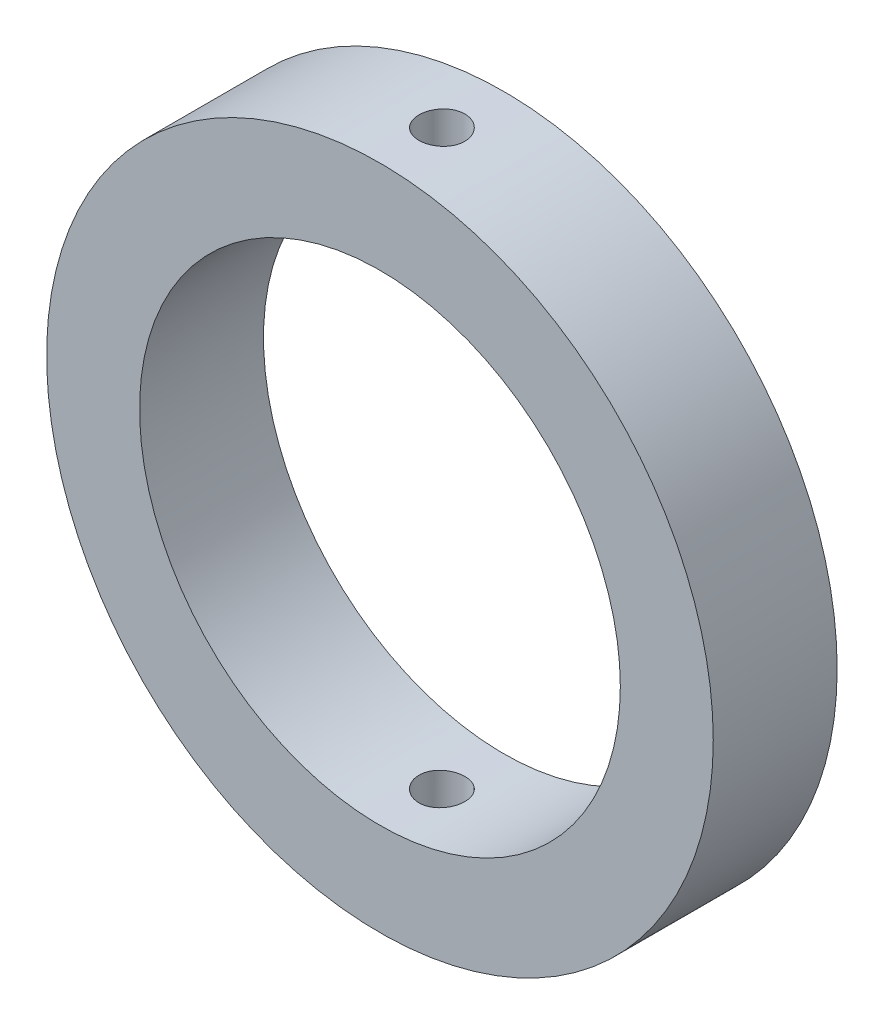
ISO-10303-21;
HEADER;
FILE_DESCRIPTION(('STEP AP214'),'2;1');
FILE_NAME('part.step','',(''),(''),'','','');
FILE_SCHEMA(('AUTOMOTIVE_DESIGN { 1 0 10303 214 1 1 1 1 }'));
ENDSEC;
DATA;
#1=APPLICATION_CONTEXT('core data for automotive mechanical design processes');
#2=APPLICATION_PROTOCOL_DEFINITION('international standard','automotive_design',2000,#1);
#3=PRODUCT_CONTEXT('',#1,'mechanical');
#4=PRODUCT('Part','Part','',(#3));
#5=PRODUCT_RELATED_PRODUCT_CATEGORY('part','',(#4));
#6=PRODUCT_DEFINITION_FORMATION('','',#4);
#7=PRODUCT_DEFINITION_CONTEXT('part definition',#1,'design');
#8=PRODUCT_DEFINITION('design','',#6,#7);
#9=PRODUCT_DEFINITION_SHAPE('','',#8);
#10=(LENGTH_UNIT() NAMED_UNIT(*) SI_UNIT(.MILLI.,.METRE.));
#11=(NAMED_UNIT(*) PLANE_ANGLE_UNIT() SI_UNIT($,.RADIAN.));
#12=(NAMED_UNIT(*) SI_UNIT($,.STERADIAN.) SOLID_ANGLE_UNIT());
#13=UNCERTAINTY_MEASURE_WITH_UNIT(LENGTH_MEASURE(1.E-05),#10,'distance_accuracy_value','');
#14=(GEOMETRIC_REPRESENTATION_CONTEXT(3) GLOBAL_UNCERTAINTY_ASSIGNED_CONTEXT((#13)) GLOBAL_UNIT_ASSIGNED_CONTEXT((#10,
#11,#12)) REPRESENTATION_CONTEXT('',''));
#15=CARTESIAN_POINT('',(0.,0.,0.));
#16=DIRECTION('',(0.,0.,1.));
#17=DIRECTION('',(1.,0.,0.));
#18=AXIS2_PLACEMENT_3D('',#15,#16,#17);
#19=CARTESIAN_POINT('',(0.,0.,25.4));
#20=DIRECTION('',(0.,0.,1.));
#21=DIRECTION('',(1.,0.,0.));
#22=AXIS2_PLACEMENT_3D('',#19,#20,#21);
#23=PLANE('',#22);
#24=CARTESIAN_POINT('',(0.,0.,25.4));
#25=DIRECTION('',(0.,0.,1.));
#26=DIRECTION('',(1.,0.,0.));
#27=AXIS2_PLACEMENT_3D('',#24,#25,#26);
#28=CIRCLE('',#27,68.326);
#29=CARTESIAN_POINT('',(68.326,0.,25.4));
#30=VERTEX_POINT('',#29);
#31=EDGE_CURVE('E10',#30,#30,#28,.T.);
#32=ORIENTED_EDGE('',*,*,#31,.T.);
#33=EDGE_LOOP('',(#32));
#34=FACE_BOUND('',#33,.T.);
#35=CARTESIAN_POINT('',(0.,0.,25.4));
#36=DIRECTION('',(0.,0.,1.));
#37=DIRECTION('',(1.,0.,0.));
#38=AXIS2_PLACEMENT_3D('',#35,#36,#37);
#39=CIRCLE('',#38,49.276);
#40=CARTESIAN_POINT('',(49.276,0.,25.4));
#41=VERTEX_POINT('',#40);
#42=EDGE_CURVE('E48',#41,#41,#39,.T.);
#43=ORIENTED_EDGE('',*,*,#42,.F.);
#44=EDGE_LOOP('',(#43));
#45=FACE_BOUND('',#44,.T.);
#46=ADVANCED_FACE('F30',(#34,#45),#23,.T.);
#47=CARTESIAN_POINT('',(0.,0.,0.));
#48=DIRECTION('',(0.,0.,1.));
#49=DIRECTION('',(1.,0.,0.));
#50=AXIS2_PLACEMENT_3D('',#47,#48,#49);
#51=PLANE('',#50);
#52=CARTESIAN_POINT('',(0.,0.,0.));
#53=DIRECTION('',(0.,0.,1.));
#54=DIRECTION('',(1.,0.,0.));
#55=AXIS2_PLACEMENT_3D('',#52,#53,#54);
#56=CIRCLE('',#55,68.326);
#57=CARTESIAN_POINT('',(68.326,0.,0.));
#58=VERTEX_POINT('',#57);
#59=EDGE_CURVE('E43',#58,#58,#56,.T.);
#60=ORIENTED_EDGE('',*,*,#59,.F.);
#61=EDGE_LOOP('',(#60));
#62=FACE_BOUND('',#61,.T.);
#63=CARTESIAN_POINT('',(0.,0.,0.));
#64=DIRECTION('',(0.,0.,1.));
#65=DIRECTION('',(1.,0.,0.));
#66=AXIS2_PLACEMENT_3D('',#63,#64,#65);
#67=CIRCLE('',#66,49.276);
#68=CARTESIAN_POINT('',(49.276,0.,0.));
#69=VERTEX_POINT('',#68);
#70=EDGE_CURVE('E51',#69,#69,#67,.T.);
#71=ORIENTED_EDGE('',*,*,#70,.T.);
#72=EDGE_LOOP('',(#71));
#73=FACE_BOUND('',#72,.T.);
#74=ADVANCED_FACE('F84',(#62,#73),#51,.F.);
#75=CARTESIAN_POINT('',(0.,0.,25.4));
#76=DIRECTION('',(0.,0.,-1.));
#77=DIRECTION('',(-1.,0.,0.));
#78=AXIS2_PLACEMENT_3D('',#75,#76,#77);
#79=CYLINDRICAL_SURFACE('',#78,68.326);
#80=CARTESIAN_POINT('',(0.,-68.326,17.399));
#81=CARTESIAN_POINT('',(0.263610645152822,-68.3259978602102,17.3989884229259));
#82=CARTESIAN_POINT('',(0.527404481505065,-68.3244581324138,17.3767428771823));
#83=CARTESIAN_POINT('',(1.04770422302524,-68.3184638834212,17.2883225209762));
#84=CARTESIAN_POINT('',(1.3042013492933,-68.3140059942158,17.2220969494876));
#85=CARTESIAN_POINT('',(1.80229606338297,-68.3026795820063,17.0476312242923));
#86=CARTESIAN_POINT('',(2.04390158518749,-68.2958123559373,16.939413671361));
#87=CARTESIAN_POINT('',(2.50545675359367,-68.2804390301372,16.6840735878991));
#88=CARTESIAN_POINT('',(2.7254112555189,-68.271933299118,16.536959807397));
#89=CARTESIAN_POINT('',(3.13787460050528,-68.2542216431329,16.2077173897638));
#90=CARTESIAN_POINT('',(3.3303396565822,-68.2450146361151,16.0255339514284));
#91=CARTESIAN_POINT('',(3.68198583620943,-68.2269473021208,15.6314377748457));
#92=CARTESIAN_POINT('',(3.8411655501303,-68.2180869898396,15.4195237781484));
#93=CARTESIAN_POINT('',(4.12186228789359,-68.2017036998519,14.9717277396979));
#94=CARTESIAN_POINT('',(4.24334217520007,-68.1941820438906,14.7358223667491));
#95=CARTESIAN_POINT('',(4.4449534308283,-68.1813385730595,14.2469033361645));
#96=CARTESIAN_POINT('',(4.52508532087781,-68.1760167304327,13.9938898944434));
#97=CARTESIAN_POINT('',(4.64160239811352,-68.1681835134897,13.4783650225439));
#98=CARTESIAN_POINT('',(4.67805720624059,-68.1656676668804,13.2158693968949));
#99=CARTESIAN_POINT('',(4.70640026831244,-68.1637167740012,12.6884736494024));
#100=CARTESIAN_POINT('',(4.69828911675897,-68.1642816866346,12.4235735596812));
#101=CARTESIAN_POINT('',(4.63778820296504,-68.1684244566682,11.89936354669));
#102=CARTESIAN_POINT('',(4.58547386485522,-68.1719971817844,11.6400448722529));
#103=CARTESIAN_POINT('',(4.43816863188483,-68.1817449017789,11.1338781884618));
#104=CARTESIAN_POINT('',(4.34317743741749,-68.1879199149262,10.8870302666704));
#105=CARTESIAN_POINT('',(4.11312963564713,-68.2021822720805,10.4125703944967));
#106=CARTESIAN_POINT('',(3.97803891549148,-68.210271243107,10.1849750350472));
#107=CARTESIAN_POINT('',(3.67165147102744,-68.2274483986898,9.75566227408349));
#108=CARTESIAN_POINT('',(3.50035425110297,-68.2365365969234,9.55394522686783));
#109=CARTESIAN_POINT('',(3.12599198575879,-68.2547108856569,9.18167634418997));
#110=CARTESIAN_POINT('',(2.9228616847617,-68.2637969325567,9.01119012222284));
#111=CARTESIAN_POINT('',(2.49082784157897,-68.2809249344769,8.70672879825254));
#112=CARTESIAN_POINT('',(2.26192428849463,-68.2889668890556,8.57275371168886));
#113=CARTESIAN_POINT('',(1.78480109829735,-68.303101393241,8.34512287232549));
#114=CARTESIAN_POINT('',(1.53658021715572,-68.3091938171691,8.2514697187844));
#115=CARTESIAN_POINT('',(1.02788670927037,-68.3187411499996,8.10718561444557));
#116=CARTESIAN_POINT('',(0.767414255773689,-68.3221960961861,8.05655405548094));
#117=CARTESIAN_POINT('',(0.242180589545063,-68.3260743743921,7.99983194688857));
#118=CARTESIAN_POINT('',(-0.0225707853000747,-68.326503879253,7.99365070424962));
#119=CARTESIAN_POINT('',(-0.549347251431478,-68.3242993154578,8.02576755689911));
#120=CARTESIAN_POINT('',(-0.811372359932456,-68.3216652661579,8.06406537115719));
#121=CARTESIAN_POINT('',(-1.32500203407734,-68.3136340105422,8.18397808884638));
#122=CARTESIAN_POINT('',(-1.57661638628705,-68.3082394660752,8.2655512661346));
#123=CARTESIAN_POINT('',(-2.06258450166646,-68.29529387371,8.46965670536518));
#124=CARTESIAN_POINT('',(-2.29693807725074,-68.2877428023794,8.59218941236445));
#125=CARTESIAN_POINT('',(-2.7421468211103,-68.2713166838243,8.87496572797061));
#126=CARTESIAN_POINT('',(-2.95296352186296,-68.2624395230917,9.03526977600667));
#127=CARTESIAN_POINT('',(-3.34472667306219,-68.2443669088747,9.38895053934302));
#128=CARTESIAN_POINT('',(-3.52567276887244,-68.2351714516129,9.58232764724503));
#129=CARTESIAN_POINT('',(-3.8528665919556,-68.2174806341977,9.99705717111062));
#130=CARTESIAN_POINT('',(-3.99905538757578,-68.2089864788044,10.2184561386273));
#131=CARTESIAN_POINT('',(-4.25218148453881,-68.1936754972733,10.6827113372308));
#132=CARTESIAN_POINT('',(-4.35911906909952,-68.1868586590328,10.9255674134778));
#133=CARTESIAN_POINT('',(-4.53060557474557,-68.1756798171572,11.425629573712));
#134=CARTESIAN_POINT('',(-4.59519131079001,-68.1713156819474,11.682822983157));
#135=CARTESIAN_POINT('',(-4.68026090389999,-68.1655285324115,12.2044344038869));
#136=CARTESIAN_POINT('',(-4.70074530897967,-68.1641054815387,12.4688523253568));
#137=CARTESIAN_POINT('',(-4.69702524041087,-68.1643618784143,12.9968210797789));
#138=CARTESIAN_POINT('',(-4.67291339664706,-68.1660348953925,13.2603725735139));
#139=CARTESIAN_POINT('',(-4.58087762978648,-68.1722812733823,13.7796748767449));
#140=CARTESIAN_POINT('',(-4.51295363022275,-68.176854639456,14.0354256726252));
#141=CARTESIAN_POINT('',(-4.33524331529335,-68.1883847539296,14.5318783565647));
#142=CARTESIAN_POINT('',(-4.22545777108491,-68.1953414584244,14.7725805217488));
#143=CARTESIAN_POINT('',(-3.96715259818161,-68.210854293287,15.2321495829805));
#144=CARTESIAN_POINT('',(-3.8186338650058,-68.2194103866753,15.4510169836905));
#145=CARTESIAN_POINT('',(-3.48673315404959,-68.2371787415847,15.8611752488392));
#146=CARTESIAN_POINT('',(-3.30328354722664,-68.2463922539221,16.0524113322531));
#147=CARTESIAN_POINT('',(-2.90683211888396,-68.2644262454691,16.4014434587444));
#148=CARTESIAN_POINT('',(-2.6938231002454,-68.2732466282667,16.5592313341393));
#149=CARTESIAN_POINT('',(-2.24401203239979,-68.2895114289935,16.8370295684314));
#150=CARTESIAN_POINT('',(-2.00717700835413,-68.2969538983266,16.9569865942757));
#151=CARTESIAN_POINT('',(-1.51684584158818,-68.3095992664035,17.1552844772613));
#152=CARTESIAN_POINT('',(-1.26336950363239,-68.3148047735855,17.2336738300216));
#153=CARTESIAN_POINT('',(-0.840297543540206,-68.3210330641481,17.3263478417239));
#154=CARTESIAN_POINT('',(-0.673433087043521,-68.3228873329409,17.3535569073187));
#155=CARTESIAN_POINT('',(-0.337737487838319,-68.3253714853465,17.3898866799511));
#156=CARTESIAN_POINT('',(-0.168906348492791,-68.3260013710527,17.3990074179148));
#157=CARTESIAN_POINT('',(0.,-68.326,17.399));
#158=B_SPLINE_CURVE_WITH_KNOTS('',3,(#80,#81,#82,#83,#84,#85,#86,#87,#88,#89,#90,#91,#92,#93,
#94,#95,#96,#97,#98,#99,#100,#101,#102,#103,#104,#105,#106,#107,#108,#109,#110,#111,#112,#113,
#114,#115,#116,#117,#118,#119,#120,#121,#122,#123,#124,#125,#126,#127,#128,#129,#130,#131,#132,
#133,#134,#135,#136,#137,#138,#139,#140,#141,#142,#143,#144,#145,#146,#147,#148,#149,#150,#151,
#152,#153,#154,#155,#156,#157),.UNSPECIFIED.,.T.,.F.,(4,2,2,2,2,2,2,2,2,2,2,2,2,2,2,2,2,2,2,2,2,
2,2,2,2,2,2,2,2,2,2,2,2,2,2,2,2,2,4),(0.,0.790215304567186,1.58134425153211,2.37204798915933,
3.16257400255365,3.95434550028978,4.74615052264662,5.53873306153618,6.33130559939937,
7.12261309460821,7.9139100339454,8.70385949938502,9.49381451063849,10.2844434757008,
11.0750832640634,11.8673655363161,12.6596481436014,13.4519818158782,14.2443042872889,
15.0350097049169,15.8257101266877,16.6156495363816,17.4055975296559,18.1968182387696,
18.9880483409115,19.7806105711881,20.5731670826041,21.3650337362704,22.1568905499472,
22.9471044620649,23.7373197533757,24.5275204883484,25.3177029553415,26.109431128938,
26.9013524116619,27.6943851869066,28.4864907102591,28.9928155202541,29.4991394645704),.UNSPECIFIED.);
#159=CARTESIAN_POINT('',(0.,-68.326,17.399));
#160=VERTEX_POINT('',#159);
#161=EDGE_CURVE('E74',#160,#160,#158,.T.);
#162=ORIENTED_EDGE('',*,*,#161,.T.);
#163=EDGE_LOOP('',(#162));
#164=FACE_BOUND('',#163,.T.);
#165=CARTESIAN_POINT('',(0.,68.326,17.399));
#166=CARTESIAN_POINT('',(-0.263610645152822,68.3259978602102,17.3989884229259));
#167=CARTESIAN_POINT('',(-0.527404481505065,68.3244581324138,17.3767428771823));
#168=CARTESIAN_POINT('',(-1.04770422302524,68.3184638834212,17.2883225209762));
#169=CARTESIAN_POINT('',(-1.3042013492933,68.3140059942158,17.2220969494876));
#170=CARTESIAN_POINT('',(-1.80229606338297,68.3026795820063,17.0476312242923));
#171=CARTESIAN_POINT('',(-2.04390158518749,68.2958123559373,16.939413671361));
#172=CARTESIAN_POINT('',(-2.50545675359367,68.2804390301372,16.6840735878991));
#173=CARTESIAN_POINT('',(-2.7254112555189,68.271933299118,16.536959807397));
#174=CARTESIAN_POINT('',(-3.13787460050528,68.2542216431329,16.2077173897638));
#175=CARTESIAN_POINT('',(-3.3303396565822,68.2450146361151,16.0255339514284));
#176=CARTESIAN_POINT('',(-3.68198583620943,68.2269473021208,15.6314377748457));
#177=CARTESIAN_POINT('',(-3.8411655501303,68.2180869898396,15.4195237781484));
#178=CARTESIAN_POINT('',(-4.12186228789359,68.2017036998519,14.9717277396979));
#179=CARTESIAN_POINT('',(-4.24334217520007,68.1941820438906,14.7358223667491));
#180=CARTESIAN_POINT('',(-4.4449534308283,68.1813385730595,14.2469033361645));
#181=CARTESIAN_POINT('',(-4.52508532087781,68.1760167304327,13.9938898944434));
#182=CARTESIAN_POINT('',(-4.64160239811352,68.1681835134897,13.4783650225439));
#183=CARTESIAN_POINT('',(-4.67805720624059,68.1656676668804,13.2158693968949));
#184=CARTESIAN_POINT('',(-4.70640026831244,68.1637167740012,12.6884736494024));
#185=CARTESIAN_POINT('',(-4.69828911675897,68.1642816866346,12.4235735596812));
#186=CARTESIAN_POINT('',(-4.63778820296504,68.1684244566682,11.89936354669));
#187=CARTESIAN_POINT('',(-4.58547386485522,68.1719971817844,11.6400448722529));
#188=CARTESIAN_POINT('',(-4.43816863188483,68.1817449017789,11.1338781884618));
#189=CARTESIAN_POINT('',(-4.34317743741749,68.1879199149262,10.8870302666704));
#190=CARTESIAN_POINT('',(-4.11312963564713,68.2021822720805,10.4125703944967));
#191=CARTESIAN_POINT('',(-3.97803891549148,68.210271243107,10.1849750350472));
#192=CARTESIAN_POINT('',(-3.67165147102744,68.2274483986898,9.75566227408349));
#193=CARTESIAN_POINT('',(-3.50035425110297,68.2365365969234,9.55394522686783));
#194=CARTESIAN_POINT('',(-3.12599198575879,68.2547108856569,9.18167634418997));
#195=CARTESIAN_POINT('',(-2.9228616847617,68.2637969325567,9.01119012222284));
#196=CARTESIAN_POINT('',(-2.49082784157897,68.2809249344769,8.70672879825254));
#197=CARTESIAN_POINT('',(-2.26192428849463,68.2889668890556,8.57275371168886));
#198=CARTESIAN_POINT('',(-1.78480109829735,68.303101393241,8.34512287232549));
#199=CARTESIAN_POINT('',(-1.53658021715572,68.3091938171691,8.2514697187844));
#200=CARTESIAN_POINT('',(-1.02788670927037,68.3187411499996,8.10718561444557));
#201=CARTESIAN_POINT('',(-0.767414255773689,68.3221960961861,8.05655405548094));
#202=CARTESIAN_POINT('',(-0.242180589545063,68.3260743743921,7.99983194688857));
#203=CARTESIAN_POINT('',(0.0225707853000747,68.326503879253,7.99365070424962));
#204=CARTESIAN_POINT('',(0.549347251431478,68.3242993154578,8.02576755689911));
#205=CARTESIAN_POINT('',(0.811372359932456,68.3216652661579,8.06406537115719));
#206=CARTESIAN_POINT('',(1.32500203407734,68.3136340105422,8.18397808884638));
#207=CARTESIAN_POINT('',(1.57661638628705,68.3082394660752,8.2655512661346));
#208=CARTESIAN_POINT('',(2.06258450166646,68.29529387371,8.46965670536518));
#209=CARTESIAN_POINT('',(2.29693807725074,68.2877428023794,8.59218941236445));
#210=CARTESIAN_POINT('',(2.7421468211103,68.2713166838243,8.87496572797061));
#211=CARTESIAN_POINT('',(2.95296352186296,68.2624395230917,9.03526977600667));
#212=CARTESIAN_POINT('',(3.34472667306219,68.2443669088747,9.38895053934302));
#213=CARTESIAN_POINT('',(3.52567276887244,68.2351714516129,9.58232764724503));
#214=CARTESIAN_POINT('',(3.8528665919556,68.2174806341977,9.99705717111062));
#215=CARTESIAN_POINT('',(3.99905538757578,68.2089864788044,10.2184561386273));
#216=CARTESIAN_POINT('',(4.25218148453881,68.1936754972733,10.6827113372308));
#217=CARTESIAN_POINT('',(4.35911906909952,68.1868586590328,10.9255674134778));
#218=CARTESIAN_POINT('',(4.53060557474557,68.1756798171572,11.425629573712));
#219=CARTESIAN_POINT('',(4.59519131079001,68.1713156819474,11.682822983157));
#220=CARTESIAN_POINT('',(4.68026090389999,68.1655285324115,12.2044344038869));
#221=CARTESIAN_POINT('',(4.70074530897967,68.1641054815387,12.4688523253568));
#222=CARTESIAN_POINT('',(4.69702524041087,68.1643618784143,12.9968210797789));
#223=CARTESIAN_POINT('',(4.67291339664706,68.1660348953925,13.2603725735139));
#224=CARTESIAN_POINT('',(4.58087762978648,68.1722812733823,13.7796748767449));
#225=CARTESIAN_POINT('',(4.51295363022275,68.176854639456,14.0354256726252));
#226=CARTESIAN_POINT('',(4.33524331529335,68.1883847539296,14.5318783565647));
#227=CARTESIAN_POINT('',(4.22545777108491,68.1953414584244,14.7725805217488));
#228=CARTESIAN_POINT('',(3.96715259818161,68.210854293287,15.2321495829805));
#229=CARTESIAN_POINT('',(3.8186338650058,68.2194103866753,15.4510169836905));
#230=CARTESIAN_POINT('',(3.48673315404959,68.2371787415847,15.8611752488392));
#231=CARTESIAN_POINT('',(3.30328354722664,68.2463922539221,16.0524113322531));
#232=CARTESIAN_POINT('',(2.90683211888396,68.2644262454691,16.4014434587444));
#233=CARTESIAN_POINT('',(2.6938231002454,68.2732466282667,16.5592313341393));
#234=CARTESIAN_POINT('',(2.24401203239979,68.2895114289935,16.8370295684314));
#235=CARTESIAN_POINT('',(2.00717700835413,68.2969538983266,16.9569865942757));
#236=CARTESIAN_POINT('',(1.51684584158818,68.3095992664035,17.1552844772613));
#237=CARTESIAN_POINT('',(1.26336950363239,68.3148047735855,17.2336738300216));
#238=CARTESIAN_POINT('',(0.840297543540206,68.3210330641481,17.3263478417239));
#239=CARTESIAN_POINT('',(0.673433087043521,68.3228873329409,17.3535569073187));
#240=CARTESIAN_POINT('',(0.337737487838319,68.3253714853465,17.3898866799511));
#241=CARTESIAN_POINT('',(0.168906348492791,68.3260013710527,17.3990074179148));
#242=CARTESIAN_POINT('',(0.,68.326,17.399));
#243=B_SPLINE_CURVE_WITH_KNOTS('',3,(#165,#166,#167,#168,#169,#170,#171,#172,#173,#174,#175,
#176,#177,#178,#179,#180,#181,#182,#183,#184,#185,#186,#187,#188,#189,#190,#191,#192,#193,#194,
#195,#196,#197,#198,#199,#200,#201,#202,#203,#204,#205,#206,#207,#208,#209,#210,#211,#212,#213,
#214,#215,#216,#217,#218,#219,#220,#221,#222,#223,#224,#225,#226,#227,#228,#229,#230,#231,#232,
#233,#234,#235,#236,#237,#238,#239,#240,#241,#242),.UNSPECIFIED.,.T.,.F.,(4,2,2,2,2,2,2,2,2,2,2,
2,2,2,2,2,2,2,2,2,2,2,2,2,2,2,2,2,2,2,2,2,2,2,2,2,2,2,4),(0.,0.790215304567186,1.58134425153211,
2.37204798915933,3.16257400255365,3.95434550028978,4.74615052264662,5.53873306153618,
6.33130559939937,7.12261309460821,7.9139100339454,8.70385949938502,9.49381451063849,
10.2844434757008,11.0750832640634,11.8673655363161,12.6596481436014,13.4519818158782,
14.2443042872889,15.0350097049169,15.8257101266877,16.6156495363816,17.4055975296559,
18.1968182387696,18.9880483409115,19.7806105711881,20.5731670826041,21.3650337362704,
22.1568905499472,22.9471044620649,23.7373197533757,24.5275204883484,25.3177029553415,
26.109431128938,26.9013524116619,27.6943851869066,28.4864907102591,28.9928155202541,
29.4991394645704),.UNSPECIFIED.);
#244=CARTESIAN_POINT('',(0.,68.326,17.399));
#245=VERTEX_POINT('',#244);
#246=EDGE_CURVE('E70',#245,#245,#243,.T.);
#247=ORIENTED_EDGE('',*,*,#246,.T.);
#248=EDGE_LOOP('',(#247));
#249=FACE_BOUND('',#248,.T.);
#250=ORIENTED_EDGE('',*,*,#31,.F.);
#251=EDGE_LOOP('',(#250));
#252=FACE_BOUND('',#251,.T.);
#253=ORIENTED_EDGE('',*,*,#59,.T.);
#254=EDGE_LOOP('',(#253));
#255=FACE_BOUND('',#254,.T.);
#256=ADVANCED_FACE('F32',(#164,#249,#252,#255),#79,.T.);
#257=CARTESIAN_POINT('',(0.,0.,25.4));
#258=DIRECTION('',(0.,0.,-1.));
#259=DIRECTION('',(-1.,0.,0.));
#260=AXIS2_PLACEMENT_3D('',#257,#258,#259);
#261=CYLINDRICAL_SURFACE('',#260,49.276);
#262=CARTESIAN_POINT('',(0.,-49.276,17.399));
#263=CARTESIAN_POINT('',(0.263303335643799,-49.2759970967554,17.3989885673862));
#264=CARTESIAN_POINT('',(0.526782286354543,-49.2738671350221,17.3767946372984));
#265=CARTESIAN_POINT('',(1.04643989204769,-49.2655751021183,17.2885912814618));
#266=CARTESIAN_POINT('',(1.30261010642568,-49.2594085514732,17.2225331776838));
#267=CARTESIAN_POINT('',(1.80004952167016,-49.2437396583182,17.0485381944115));
#268=CARTESIAN_POINT('',(2.04132745598631,-49.2342392931769,16.9406261355578));
#269=CARTESIAN_POINT('',(2.50229161857994,-49.2129659981646,16.686033557329));
#270=CARTESIAN_POINT('',(2.72198222407507,-49.2011935304441,16.5393609197011));
#271=CARTESIAN_POINT('',(3.13431196523453,-49.1766521623964,16.2108923368287));
#272=CARTESIAN_POINT('',(3.32687020707246,-49.1638804518687,16.0289950453942));
#273=CARTESIAN_POINT('',(3.67877424724266,-49.1388033866821,15.6354562298596));
#274=CARTESIAN_POINT('',(3.83811853280434,-49.1264980532859,15.4238133516948));
#275=CARTESIAN_POINT('',(4.11935461225409,-49.1037178963491,14.9762891863453));
#276=CARTESIAN_POINT('',(4.24117376595355,-49.0932466398535,14.7403620530005));
#277=CARTESIAN_POINT('',(4.44343771333917,-49.0753543868374,14.2512848469483));
#278=CARTESIAN_POINT('',(4.52388344241312,-49.0679333213577,13.9981351637622));
#279=CARTESIAN_POINT('',(4.64087852996036,-49.0570066368322,13.4826201430331));
#280=CARTESIAN_POINT('',(4.6775614449155,-49.0534891071808,13.2202853725233));
#281=CARTESIAN_POINT('',(4.7064023852107,-49.0507306133178,12.6931606665401));
#282=CARTESIAN_POINT('',(4.69856148142363,-49.0514895462502,12.4283707902691));
#283=CARTESIAN_POINT('',(4.63868752450604,-49.0571873644343,11.9047713297039));
#284=CARTESIAN_POINT('',(4.58680009500121,-49.0621124755631,11.6459449223235));
#285=CARTESIAN_POINT('',(4.44053246513447,-49.0755661751524,11.1406911824682));
#286=CARTESIAN_POINT('',(4.34615173767562,-49.0840948083118,10.8942640038385));
#287=CARTESIAN_POINT('',(4.11741521063223,-49.1038104465146,10.4203426614259));
#288=CARTESIAN_POINT('',(3.98299458760197,-49.1150017563969,10.192879970819));
#289=CARTESIAN_POINT('',(3.6780406003689,-49.1387780380999,9.76368877225485));
#290=CARTESIAN_POINT('',(3.50750627560324,-49.1513630469862,9.56196094902992));
#291=CARTESIAN_POINT('',(3.13435137142203,-49.1765700691329,9.18911943273787));
#292=CARTESIAN_POINT('',(2.93160498954849,-49.1891920286646,9.01813161895612));
#293=CARTESIAN_POINT('',(2.50021864007918,-49.2130030489253,8.71259879022746));
#294=CARTESIAN_POINT('',(2.27157864729234,-49.2241921082601,8.57805381073506));
#295=CARTESIAN_POINT('',(1.79480970910502,-49.2438798222691,8.34923176378121));
#296=CARTESIAN_POINT('',(1.54667779591191,-49.2523780662513,8.2549608424738));
#297=CARTESIAN_POINT('',(1.03800863360827,-49.2657223015112,8.10945394895822));
#298=CARTESIAN_POINT('',(0.777471721974208,-49.2705683920849,8.05821680672742));
#299=CARTESIAN_POINT('',(0.252478658231735,-49.2760495477496,8.00039104467325));
#300=CARTESIAN_POINT('',(-0.0119581917343203,-49.276701000218,7.9936286710914));
#301=CARTESIAN_POINT('',(-0.538202375532641,-49.273763368807,8.02448839688168));
#302=CARTESIAN_POINT('',(-0.800009741578493,-49.2701743369415,8.06210995183949));
#303=CARTESIAN_POINT('',(-1.31306350513088,-49.2591696451004,8.18052548805363));
#304=CARTESIAN_POINT('',(-1.56432879123858,-49.2517611755572,8.26123835618339));
#305=CARTESIAN_POINT('',(-2.04975242723517,-49.2339490618343,8.46346217080555));
#306=CARTESIAN_POINT('',(-2.28391042656747,-49.2235453562988,8.58497395304982));
#307=CARTESIAN_POINT('',(-2.72925972254142,-49.2008664019836,8.86577893143477));
#308=CARTESIAN_POINT('',(-2.94037857017969,-49.1885855253032,9.02518656802174));
#309=CARTESIAN_POINT('',(-3.33292391330128,-49.1635490727528,9.37709380692278));
#310=CARTESIAN_POINT('',(-3.51434973184228,-49.1507934860684,9.56959416348034));
#311=CARTESIAN_POINT('',(-3.8429601431697,-49.1261961718312,9.98297938331043));
#312=CARTESIAN_POINT('',(-3.99003089243891,-49.114357567155,10.2039549555655));
#313=CARTESIAN_POINT('',(-4.24497435835431,-49.0929812247975,10.6675693053502));
#314=CARTESIAN_POINT('',(-4.35284756874712,-49.0834434581346,10.9102078099575));
#315=CARTESIAN_POINT('',(-4.52614225436162,-49.0677676580159,11.4098662316934));
#316=CARTESIAN_POINT('',(-4.59163204426275,-49.0616241559483,11.6668622768434));
#317=CARTESIAN_POINT('',(-4.67852276176501,-49.053415129573,12.1882643068246));
#318=CARTESIAN_POINT('',(-4.69992482923572,-49.0513494998337,12.4526700999007));
#319=CARTESIAN_POINT('',(-4.69801755525741,-49.0515321243658,12.9802546585158));
#320=CARTESIAN_POINT('',(-4.67488705606372,-49.0537631234386,13.2434340948955));
#321=CARTESIAN_POINT('',(-4.58494561037228,-49.0622508757789,13.7621508420076));
#322=CARTESIAN_POINT('',(-4.51813460905088,-49.0685076340992,14.0176881431479));
#323=CARTESIAN_POINT('',(-4.34277686539682,-49.0843372144039,14.513869271658));
#324=CARTESIAN_POINT('',(-4.23423479014966,-49.0939096655588,14.7545147609934));
#325=CARTESIAN_POINT('',(-3.97851482293199,-49.115292794814,15.2141992585971));
#326=CARTESIAN_POINT('',(-3.83133726232095,-49.1271034537179,15.4332384521509));
#327=CARTESIAN_POINT('',(-3.50185199273922,-49.151688964399,15.8444090698137));
#328=CARTESIAN_POINT('',(-3.31941118001605,-49.1644673541343,16.0364336235189));
#329=CARTESIAN_POINT('',(-2.92483673989158,-49.1895161537835,16.3872243916478));
#330=CARTESIAN_POINT('',(-2.71269598996384,-49.2017864409289,16.5459826053947));
#331=CARTESIAN_POINT('',(-2.26421221826653,-49.2244655896615,16.8260177198848));
#332=CARTESIAN_POINT('',(-2.02781418112755,-49.234870066043,16.9472067964364));
#333=CARTESIAN_POINT('',(-1.53807911788508,-49.252596697794,17.1480108109837));
#334=CARTESIAN_POINT('',(-1.28476167119429,-49.2599223467924,17.2276728955997));
#335=CARTESIAN_POINT('',(-0.858326605807201,-49.2688133511304,17.3231714860844));
#336=CARTESIAN_POINT('',(-0.687940053788652,-49.2714958661634,17.3515686415938));
#337=CARTESIAN_POINT('',(-0.345060807538974,-49.2750901387392,17.3894866103838));
#338=CARTESIAN_POINT('',(-0.172568121034807,-49.2760019027767,17.3990074928966));
#339=CARTESIAN_POINT('',(0.,-49.276,17.399));
#340=B_SPLINE_CURVE_WITH_KNOTS('',3,(#262,#263,#264,#265,#266,#267,#268,#269,#270,#271,#272,
#273,#274,#275,#276,#277,#278,#279,#280,#281,#282,#283,#284,#285,#286,#287,#288,#289,#290,#291,
#292,#293,#294,#295,#296,#297,#298,#299,#300,#301,#302,#303,#304,#305,#306,#307,#308,#309,#310,
#311,#312,#313,#314,#315,#316,#317,#318,#319,#320,#321,#322,#323,#324,#325,#326,#327,#328,#329,
#330,#331,#332,#333,#334,#335,#336,#337,#338,#339),.UNSPECIFIED.,.T.,.F.,(4,2,2,2,2,2,2,2,2,2,2,
2,2,2,2,2,2,2,2,2,2,2,2,2,2,2,2,2,2,2,2,2,2,2,2,2,2,2,4),(0.,0.78927988025261,1.57943712669362,
2.36912650109175,3.15865541996306,3.95049060936617,4.74236185600252,5.53575649104036,
6.32913318789037,7.12008239242533,7.91101257337961,8.6993379736148,9.48767315269434,
10.2772916256524,11.0669311037533,11.8597339203461,12.652537508238,13.4454620413268,
14.2383650153124,15.0281684311813,15.8179621594033,16.6062744306019,17.3946028510942,
18.1853428564561,18.9761008866156,19.7694432389164,20.5627755976385,21.354826037135,
22.1468559982423,22.9357118103238,23.7245686125049,24.5133372168193,25.302099056435,
26.0938984230907,26.8858880023798,27.6797152678282,28.4726393078569,28.9899325853243,
29.5072239655217),.UNSPECIFIED.);
#341=CARTESIAN_POINT('',(0.,-49.276,17.399));
#342=VERTEX_POINT('',#341);
#343=EDGE_CURVE('E35',#342,#342,#340,.T.);
#344=ORIENTED_EDGE('',*,*,#343,.F.);
#345=EDGE_LOOP('',(#344));
#346=FACE_BOUND('',#345,.T.);
#347=CARTESIAN_POINT('',(0.,49.276,17.399));
#348=CARTESIAN_POINT('',(-0.263303335643799,49.2759970967554,17.3989885673862));
#349=CARTESIAN_POINT('',(-0.526782286354543,49.2738671350221,17.3767946372984));
#350=CARTESIAN_POINT('',(-1.04643989204769,49.2655751021183,17.2885912814618));
#351=CARTESIAN_POINT('',(-1.30261010642568,49.2594085514732,17.2225331776838));
#352=CARTESIAN_POINT('',(-1.80004952167016,49.2437396583182,17.0485381944115));
#353=CARTESIAN_POINT('',(-2.04132745598631,49.2342392931769,16.9406261355578));
#354=CARTESIAN_POINT('',(-2.50229161857994,49.2129659981646,16.686033557329));
#355=CARTESIAN_POINT('',(-2.72198222407507,49.2011935304441,16.5393609197011));
#356=CARTESIAN_POINT('',(-3.13431196523453,49.1766521623964,16.2108923368287));
#357=CARTESIAN_POINT('',(-3.32687020707246,49.1638804518687,16.0289950453942));
#358=CARTESIAN_POINT('',(-3.67877424724266,49.1388033866821,15.6354562298596));
#359=CARTESIAN_POINT('',(-3.83811853280434,49.1264980532859,15.4238133516948));
#360=CARTESIAN_POINT('',(-4.11935461225409,49.1037178963491,14.9762891863453));
#361=CARTESIAN_POINT('',(-4.24117376595355,49.0932466398535,14.7403620530005));
#362=CARTESIAN_POINT('',(-4.44343771333917,49.0753543868374,14.2512848469483));
#363=CARTESIAN_POINT('',(-4.52388344241312,49.0679333213577,13.9981351637622));
#364=CARTESIAN_POINT('',(-4.64087852996036,49.0570066368322,13.4826201430331));
#365=CARTESIAN_POINT('',(-4.6775614449155,49.0534891071808,13.2202853725233));
#366=CARTESIAN_POINT('',(-4.7064023852107,49.0507306133178,12.6931606665401));
#367=CARTESIAN_POINT('',(-4.69856148142363,49.0514895462502,12.4283707902691));
#368=CARTESIAN_POINT('',(-4.63868752450604,49.0571873644343,11.9047713297039));
#369=CARTESIAN_POINT('',(-4.58680009500121,49.0621124755631,11.6459449223235));
#370=CARTESIAN_POINT('',(-4.44053246513447,49.0755661751524,11.1406911824682));
#371=CARTESIAN_POINT('',(-4.34615173767562,49.0840948083118,10.8942640038385));
#372=CARTESIAN_POINT('',(-4.11741521063223,49.1038104465146,10.4203426614259));
#373=CARTESIAN_POINT('',(-3.98299458760197,49.1150017563969,10.192879970819));
#374=CARTESIAN_POINT('',(-3.6780406003689,49.1387780380999,9.76368877225485));
#375=CARTESIAN_POINT('',(-3.50750627560324,49.1513630469862,9.56196094902992));
#376=CARTESIAN_POINT('',(-3.13435137142203,49.1765700691329,9.18911943273787));
#377=CARTESIAN_POINT('',(-2.93160498954849,49.1891920286646,9.01813161895612));
#378=CARTESIAN_POINT('',(-2.50021864007918,49.2130030489253,8.71259879022746));
#379=CARTESIAN_POINT('',(-2.27157864729234,49.2241921082601,8.57805381073506));
#380=CARTESIAN_POINT('',(-1.79480970910502,49.2438798222691,8.34923176378121));
#381=CARTESIAN_POINT('',(-1.54667779591191,49.2523780662513,8.2549608424738));
#382=CARTESIAN_POINT('',(-1.03800863360827,49.2657223015112,8.10945394895822));
#383=CARTESIAN_POINT('',(-0.777471721974208,49.2705683920849,8.05821680672742));
#384=CARTESIAN_POINT('',(-0.252478658231735,49.2760495477496,8.00039104467325));
#385=CARTESIAN_POINT('',(0.0119581917343203,49.276701000218,7.9936286710914));
#386=CARTESIAN_POINT('',(0.538202375532641,49.273763368807,8.02448839688168));
#387=CARTESIAN_POINT('',(0.800009741578493,49.2701743369415,8.06210995183949));
#388=CARTESIAN_POINT('',(1.31306350513088,49.2591696451004,8.18052548805363));
#389=CARTESIAN_POINT('',(1.56432879123858,49.2517611755572,8.26123835618339));
#390=CARTESIAN_POINT('',(2.04975242723517,49.2339490618343,8.46346217080555));
#391=CARTESIAN_POINT('',(2.28391042656747,49.2235453562988,8.58497395304982));
#392=CARTESIAN_POINT('',(2.72925972254142,49.2008664019836,8.86577893143477));
#393=CARTESIAN_POINT('',(2.94037857017969,49.1885855253032,9.02518656802174));
#394=CARTESIAN_POINT('',(3.33292391330128,49.1635490727528,9.37709380692278));
#395=CARTESIAN_POINT('',(3.51434973184228,49.1507934860684,9.56959416348034));
#396=CARTESIAN_POINT('',(3.8429601431697,49.1261961718312,9.98297938331043));
#397=CARTESIAN_POINT('',(3.99003089243891,49.114357567155,10.2039549555655));
#398=CARTESIAN_POINT('',(4.24497435835431,49.0929812247975,10.6675693053502));
#399=CARTESIAN_POINT('',(4.35284756874712,49.0834434581346,10.9102078099575));
#400=CARTESIAN_POINT('',(4.52614225436162,49.0677676580159,11.4098662316934));
#401=CARTESIAN_POINT('',(4.59163204426275,49.0616241559483,11.6668622768434));
#402=CARTESIAN_POINT('',(4.67852276176501,49.053415129573,12.1882643068246));
#403=CARTESIAN_POINT('',(4.69992482923572,49.0513494998337,12.4526700999007));
#404=CARTESIAN_POINT('',(4.69801755525741,49.0515321243658,12.9802546585158));
#405=CARTESIAN_POINT('',(4.67488705606372,49.0537631234386,13.2434340948955));
#406=CARTESIAN_POINT('',(4.58494561037228,49.0622508757789,13.7621508420076));
#407=CARTESIAN_POINT('',(4.51813460905088,49.0685076340992,14.0176881431479));
#408=CARTESIAN_POINT('',(4.34277686539682,49.0843372144039,14.513869271658));
#409=CARTESIAN_POINT('',(4.23423479014966,49.0939096655588,14.7545147609934));
#410=CARTESIAN_POINT('',(3.97851482293199,49.115292794814,15.2141992585971));
#411=CARTESIAN_POINT('',(3.83133726232095,49.1271034537179,15.4332384521509));
#412=CARTESIAN_POINT('',(3.50185199273922,49.151688964399,15.8444090698137));
#413=CARTESIAN_POINT('',(3.31941118001605,49.1644673541343,16.0364336235189));
#414=CARTESIAN_POINT('',(2.92483673989158,49.1895161537835,16.3872243916478));
#415=CARTESIAN_POINT('',(2.71269598996384,49.2017864409289,16.5459826053947));
#416=CARTESIAN_POINT('',(2.26421221826653,49.2244655896615,16.8260177198848));
#417=CARTESIAN_POINT('',(2.02781418112755,49.234870066043,16.9472067964364));
#418=CARTESIAN_POINT('',(1.53807911788508,49.252596697794,17.1480108109837));
#419=CARTESIAN_POINT('',(1.28476167119429,49.2599223467924,17.2276728955997));
#420=CARTESIAN_POINT('',(0.858326605807201,49.2688133511304,17.3231714860844));
#421=CARTESIAN_POINT('',(0.687940053788652,49.2714958661634,17.3515686415938));
#422=CARTESIAN_POINT('',(0.345060807538974,49.2750901387392,17.3894866103838));
#423=CARTESIAN_POINT('',(0.172568121034807,49.2760019027767,17.3990074928966));
#424=CARTESIAN_POINT('',(0.,49.276,17.399));
#425=B_SPLINE_CURVE_WITH_KNOTS('',3,(#347,#348,#349,#350,#351,#352,#353,#354,#355,#356,#357,
#358,#359,#360,#361,#362,#363,#364,#365,#366,#367,#368,#369,#370,#371,#372,#373,#374,#375,#376,
#377,#378,#379,#380,#381,#382,#383,#384,#385,#386,#387,#388,#389,#390,#391,#392,#393,#394,#395,
#396,#397,#398,#399,#400,#401,#402,#403,#404,#405,#406,#407,#408,#409,#410,#411,#412,#413,#414,
#415,#416,#417,#418,#419,#420,#421,#422,#423,#424),.UNSPECIFIED.,.T.,.F.,(4,2,2,2,2,2,2,2,2,2,2,
2,2,2,2,2,2,2,2,2,2,2,2,2,2,2,2,2,2,2,2,2,2,2,2,2,2,2,4),(0.,0.78927988025261,1.57943712669362,
2.36912650109175,3.15865541996306,3.95049060936617,4.74236185600252,5.53575649104036,
6.32913318789037,7.12008239242533,7.91101257337961,8.6993379736148,9.48767315269434,
10.2772916256524,11.0669311037533,11.8597339203461,12.652537508238,13.4454620413268,
14.2383650153124,15.0281684311813,15.8179621594033,16.6062744306019,17.3946028510942,
18.1853428564561,18.9761008866156,19.7694432389164,20.5627755976385,21.354826037135,
22.1468559982423,22.9357118103238,23.7245686125049,24.5133372168193,25.302099056435,
26.0938984230907,26.8858880023798,27.6797152678282,28.4726393078569,28.9899325853243,
29.5072239655217),.UNSPECIFIED.);
#426=CARTESIAN_POINT('',(0.,49.276,17.399));
#427=VERTEX_POINT('',#426);
#428=EDGE_CURVE('E53',#427,#427,#425,.T.);
#429=ORIENTED_EDGE('',*,*,#428,.F.);
#430=EDGE_LOOP('',(#429));
#431=FACE_BOUND('',#430,.T.);
#432=ORIENTED_EDGE('',*,*,#42,.T.);
#433=EDGE_LOOP('',(#432));
#434=FACE_BOUND('',#433,.T.);
#435=ORIENTED_EDGE('',*,*,#70,.F.);
#436=EDGE_LOOP('',(#435));
#437=FACE_BOUND('',#436,.T.);
#438=ADVANCED_FACE('F57',(#346,#431,#434,#437),#261,.F.);
#439=CARTESIAN_POINT('',(0.,-68.326,12.7));
#440=DIRECTION('',(0.,1.,0.));
#441=DIRECTION('',(0.,0.,1.));
#442=AXIS2_PLACEMENT_3D('',#439,#440,#441);
#443=CYLINDRICAL_SURFACE('',#442,4.699);
#444=ORIENTED_EDGE('',*,*,#428,.T.);
#445=EDGE_LOOP('',(#444));
#446=FACE_BOUND('',#445,.T.);
#447=ORIENTED_EDGE('',*,*,#246,.F.);
#448=EDGE_LOOP('',(#447));
#449=FACE_BOUND('',#448,.T.);
#450=ADVANCED_FACE('F63',(#446,#449),#443,.F.);
#451=ORIENTED_EDGE('',*,*,#343,.T.);
#452=EDGE_LOOP('',(#451));
#453=FACE_BOUND('',#452,.T.);
#454=ORIENTED_EDGE('',*,*,#161,.F.);
#455=EDGE_LOOP('',(#454));
#456=FACE_BOUND('',#455,.T.);
#457=ADVANCED_FACE('F60',(#453,#456),#443,.F.);
#458=CLOSED_SHELL('',(#46,#74,#256,#438,#450,#457));
#459=MANIFOLD_SOLID_BREP('B2',#458);
#460=ADVANCED_BREP_SHAPE_REPRESENTATION('',(#18,#459),#14);
#461=SHAPE_DEFINITION_REPRESENTATION(#9,#460);
ENDSEC;
END-ISO-10303-21;
